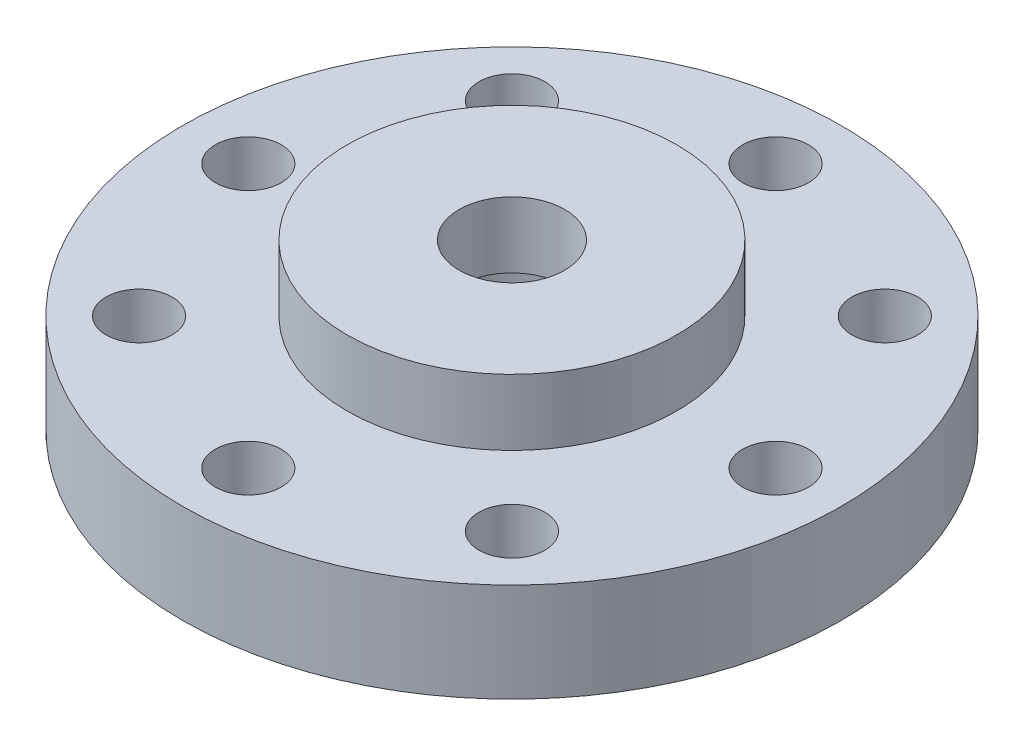
ISO-10303-21;
HEADER;
FILE_DESCRIPTION(('STEP AP214'),'2;1');
FILE_NAME('part.step','',(''),(''),'','','');
FILE_SCHEMA(('AUTOMOTIVE_DESIGN { 1 0 10303 214 1 1 1 1 }'));
ENDSEC;
DATA;
#1=APPLICATION_CONTEXT('core data for automotive mechanical design processes');
#2=APPLICATION_PROTOCOL_DEFINITION('international standard','automotive_design',2000,#1);
#3=PRODUCT_CONTEXT('',#1,'mechanical');
#4=PRODUCT('Part','Part','',(#3));
#5=PRODUCT_RELATED_PRODUCT_CATEGORY('part','',(#4));
#6=PRODUCT_DEFINITION_FORMATION('','',#4);
#7=PRODUCT_DEFINITION_CONTEXT('part definition',#1,'design');
#8=PRODUCT_DEFINITION('design','',#6,#7);
#9=PRODUCT_DEFINITION_SHAPE('','',#8);
#10=(LENGTH_UNIT() NAMED_UNIT(*) SI_UNIT(.MILLI.,.METRE.));
#11=(NAMED_UNIT(*) PLANE_ANGLE_UNIT() SI_UNIT($,.RADIAN.));
#12=(NAMED_UNIT(*) SI_UNIT($,.STERADIAN.) SOLID_ANGLE_UNIT());
#13=UNCERTAINTY_MEASURE_WITH_UNIT(LENGTH_MEASURE(1.E-05),#10,'distance_accuracy_value','');
#14=(GEOMETRIC_REPRESENTATION_CONTEXT(3) GLOBAL_UNCERTAINTY_ASSIGNED_CONTEXT((#13)) GLOBAL_UNIT_ASSIGNED_CONTEXT((#10,
#11,#12)) REPRESENTATION_CONTEXT('',''));
#15=CARTESIAN_POINT('',(0.,0.,0.));
#16=DIRECTION('',(0.,0.,1.));
#17=DIRECTION('',(1.,0.,0.));
#18=AXIS2_PLACEMENT_3D('',#15,#16,#17);
#19=CARTESIAN_POINT('',(0.,5.,0.));
#20=DIRECTION('',(0.,-1.,0.));
#21=DIRECTION('',(0.,0.,-1.));
#22=AXIS2_PLACEMENT_3D('',#19,#20,#21);
#23=CYLINDRICAL_SURFACE('',#22,1.6);
#24=CARTESIAN_POINT('',(0.,5.,0.));
#25=DIRECTION('',(0.,-1.,0.));
#26=DIRECTION('',(0.,0.,-1.));
#27=AXIS2_PLACEMENT_3D('',#24,#25,#26);
#28=CIRCLE('',#27,1.6);
#29=CARTESIAN_POINT('',(0.,5.,-1.6));
#30=VERTEX_POINT('',#29);
#31=EDGE_CURVE('E99',#30,#30,#28,.T.);
#32=ORIENTED_EDGE('',*,*,#31,.F.);
#33=EDGE_LOOP('',(#32));
#34=FACE_BOUND('',#33,.T.);
#35=CARTESIAN_POINT('',(0.,3.,0.));
#36=DIRECTION('',(0.,-1.,0.));
#37=DIRECTION('',(0.,0.,-1.));
#38=AXIS2_PLACEMENT_3D('',#35,#36,#37);
#39=CIRCLE('',#38,1.6);
#40=CARTESIAN_POINT('',(0.,3.,-1.6));
#41=VERTEX_POINT('',#40);
#42=EDGE_CURVE('E41',#41,#41,#39,.F.);
#43=ORIENTED_EDGE('',*,*,#42,.F.);
#44=EDGE_LOOP('',(#43));
#45=FACE_BOUND('',#44,.T.);
#46=ADVANCED_FACE('F37',(#34,#45),#23,.F.);
#47=CARTESIAN_POINT('',(0.,3.,0.));
#48=DIRECTION('',(0.,-1.,0.));
#49=DIRECTION('',(0.,0.,-1.));
#50=AXIS2_PLACEMENT_3D('',#47,#48,#49);
#51=CYLINDRICAL_SURFACE('',#50,10.);
#52=CARTESIAN_POINT('',(0.,3.,0.));
#53=DIRECTION('',(0.,1.,0.));
#54=DIRECTION('',(0.,0.,1.));
#55=AXIS2_PLACEMENT_3D('',#52,#53,#54);
#56=CIRCLE('',#55,10.);
#57=CARTESIAN_POINT('',(0.,3.,10.));
#58=VERTEX_POINT('',#57);
#59=EDGE_CURVE('E46',#58,#58,#56,.T.);
#60=ORIENTED_EDGE('',*,*,#59,.F.);
#61=EDGE_LOOP('',(#60));
#62=FACE_BOUND('',#61,.T.);
#63=CARTESIAN_POINT('',(0.,0.,0.));
#64=DIRECTION('',(0.,1.,0.));
#65=DIRECTION('',(0.,0.,1.));
#66=AXIS2_PLACEMENT_3D('',#63,#64,#65);
#67=CIRCLE('',#66,10.);
#68=CARTESIAN_POINT('',(0.,0.,10.));
#69=VERTEX_POINT('',#68);
#70=EDGE_CURVE('E52',#69,#69,#67,.T.);
#71=ORIENTED_EDGE('',*,*,#70,.T.);
#72=EDGE_LOOP('',(#71));
#73=FACE_BOUND('',#72,.T.);
#74=ADVANCED_FACE('F39',(#62,#73),#51,.T.);
#75=CARTESIAN_POINT('',(0.,3.,0.));
#76=DIRECTION('',(0.,1.,0.));
#77=DIRECTION('',(0.,0.,1.));
#78=AXIS2_PLACEMENT_3D('',#75,#76,#77);
#79=PLANE('',#78);
#80=CARTESIAN_POINT('',(0.,3.,8.));
#81=DIRECTION('',(0.,1.,0.));
#82=DIRECTION('',(0.,0.,1.));
#83=AXIS2_PLACEMENT_3D('',#80,#81,#82);
#84=CIRCLE('',#83,1.);
#85=CARTESIAN_POINT('',(0.,3.,9.));
#86=VERTEX_POINT('',#85);
#87=EDGE_CURVE('E63',#86,#86,#84,.T.);
#88=ORIENTED_EDGE('',*,*,#87,.F.);
#89=EDGE_LOOP('',(#88));
#90=FACE_BOUND('',#89,.T.);
#91=CARTESIAN_POINT('',(5.65685424949245,3.,5.65685424949262));
#92=DIRECTION('',(0.,1.,0.));
#93=DIRECTION('',(0.,0.,1.));
#94=AXIS2_PLACEMENT_3D('',#91,#92,#93);
#95=CIRCLE('',#94,1.);
#96=CARTESIAN_POINT('',(5.65685424949245,3.,6.65685424949262));
#97=VERTEX_POINT('',#96);
#98=EDGE_CURVE('E68',#97,#97,#95,.T.);
#99=ORIENTED_EDGE('',*,*,#98,.F.);
#100=EDGE_LOOP('',(#99));
#101=FACE_BOUND('',#100,.T.);
#102=CARTESIAN_POINT('',(8.00000000000031,3.,3.39631537166297E-13));
#103=DIRECTION('',(0.,1.,0.));
#104=DIRECTION('',(0.,0.,1.));
#105=AXIS2_PLACEMENT_3D('',#102,#103,#104);
#106=CIRCLE('',#105,1.);
#107=CARTESIAN_POINT('',(8.00000000000031,3.,1.00000000000034));
#108=VERTEX_POINT('',#107);
#109=EDGE_CURVE('E73',#108,#108,#106,.T.);
#110=ORIENTED_EDGE('',*,*,#109,.F.);
#111=EDGE_LOOP('',(#110));
#112=FACE_BOUND('',#111,.T.);
#113=CARTESIAN_POINT('',(5.65685424949293,3.,-5.65685424949214));
#114=DIRECTION('',(0.,1.,0.));
#115=DIRECTION('',(0.,0.,1.));
#116=AXIS2_PLACEMENT_3D('',#113,#114,#115);
#117=CIRCLE('',#116,1.);
#118=CARTESIAN_POINT('',(5.65685424949293,3.,-4.65685424949214));
#119=VERTEX_POINT('',#118);
#120=EDGE_CURVE('E79',#119,#119,#117,.T.);
#121=ORIENTED_EDGE('',*,*,#120,.F.);
#122=EDGE_LOOP('',(#121));
#123=FACE_BOUND('',#122,.T.);
#124=CARTESIAN_POINT('',(6.5104174407985E-13,3.,-8.));
#125=DIRECTION('',(0.,1.,0.));
#126=DIRECTION('',(0.,0.,1.));
#127=AXIS2_PLACEMENT_3D('',#124,#125,#126);
#128=CIRCLE('',#127,1.);
#129=CARTESIAN_POINT('',(6.5104174407985E-13,3.,-7.));
#130=VERTEX_POINT('',#129);
#131=EDGE_CURVE('E83',#130,#130,#128,.T.);
#132=ORIENTED_EDGE('',*,*,#131,.F.);
#133=EDGE_LOOP('',(#132));
#134=FACE_BOUND('',#133,.T.);
#135=CARTESIAN_POINT('',(-5.65685424949183,3.,-5.65685424949262));
#136=DIRECTION('',(0.,1.,0.));
#137=DIRECTION('',(0.,0.,1.));
#138=AXIS2_PLACEMENT_3D('',#135,#136,#137);
#139=CIRCLE('',#138,0.999999999999999);
#140=CARTESIAN_POINT('',(-5.65685424949183,3.,-4.65685424949262));
#141=VERTEX_POINT('',#140);
#142=EDGE_CURVE('E87',#141,#141,#139,.T.);
#143=ORIENTED_EDGE('',*,*,#142,.F.);
#144=EDGE_LOOP('',(#143));
#145=FACE_BOUND('',#144,.T.);
#146=CARTESIAN_POINT('',(-7.99999999999969,3.,-3.40530054284763E-13));
#147=DIRECTION('',(0.,1.,0.));
#148=DIRECTION('',(0.,0.,1.));
#149=AXIS2_PLACEMENT_3D('',#146,#147,#148);
#150=CIRCLE('',#149,1.);
#151=CARTESIAN_POINT('',(-7.99999999999969,3.,0.999999999999659));
#152=VERTEX_POINT('',#151);
#153=EDGE_CURVE('E91',#152,#152,#150,.T.);
#154=ORIENTED_EDGE('',*,*,#153,.F.);
#155=EDGE_LOOP('',(#154));
#156=FACE_BOUND('',#155,.T.);
#157=CARTESIAN_POINT('',(-5.65685424949231,3.,5.65685424949214));
#158=DIRECTION('',(0.,1.,0.));
#159=DIRECTION('',(0.,0.,1.));
#160=AXIS2_PLACEMENT_3D('',#157,#158,#159);
#161=CIRCLE('',#160,0.999999999999999);
#162=CARTESIAN_POINT('',(-5.65685424949231,3.,6.65685424949214));
#163=VERTEX_POINT('',#162);
#164=EDGE_CURVE('E95',#163,#163,#161,.T.);
#165=ORIENTED_EDGE('',*,*,#164,.F.);
#166=EDGE_LOOP('',(#165));
#167=FACE_BOUND('',#166,.T.);
#168=CARTESIAN_POINT('',(0.,3.,0.));
#169=DIRECTION('',(0.,1.,0.));
#170=DIRECTION('',(0.,0.,1.));
#171=AXIS2_PLACEMENT_3D('',#168,#169,#170);
#172=CIRCLE('',#171,5.);
#173=CARTESIAN_POINT('',(0.,3.,5.));
#174=VERTEX_POINT('',#173);
#175=EDGE_CURVE('E10',#174,#174,#172,.T.);
#176=ORIENTED_EDGE('',*,*,#175,.F.);
#177=EDGE_LOOP('',(#176));
#178=FACE_BOUND('',#177,.T.);
#179=ORIENTED_EDGE('',*,*,#59,.T.);
#180=EDGE_LOOP('',(#179));
#181=FACE_BOUND('',#180,.T.);
#182=ADVANCED_FACE('F156',(#90,#101,#112,#123,#134,#145,#156,#167,#178,#181),#79,.T.);
#183=CARTESIAN_POINT('',(0.,0.,0.));
#184=DIRECTION('',(0.,1.,0.));
#185=DIRECTION('',(0.,0.,1.));
#186=AXIS2_PLACEMENT_3D('',#183,#184,#185);
#187=PLANE('',#186);
#188=CARTESIAN_POINT('',(0.,0.,0.));
#189=DIRECTION('',(0.,-1.,0.));
#190=DIRECTION('',(0.,0.,-1.));
#191=AXIS2_PLACEMENT_3D('',#188,#189,#190);
#192=CIRCLE('',#191,3.);
#193=CARTESIAN_POINT('',(0.,0.,-3.));
#194=VERTEX_POINT('',#193);
#195=EDGE_CURVE('E135',#194,#194,#192,.T.);
#196=ORIENTED_EDGE('',*,*,#195,.F.);
#197=EDGE_LOOP('',(#196));
#198=FACE_BOUND('',#197,.T.);
#199=CARTESIAN_POINT('',(0.,0.,8.));
#200=DIRECTION('',(0.,-1.,0.));
#201=DIRECTION('',(0.,0.,-1.));
#202=AXIS2_PLACEMENT_3D('',#199,#200,#201);
#203=CIRCLE('',#202,1.);
#204=CARTESIAN_POINT('',(0.,0.,7.));
#205=VERTEX_POINT('',#204);
#206=EDGE_CURVE('E103',#205,#205,#203,.T.);
#207=ORIENTED_EDGE('',*,*,#206,.F.);
#208=EDGE_LOOP('',(#207));
#209=FACE_BOUND('',#208,.T.);
#210=CARTESIAN_POINT('',(5.65685424949245,0.,5.65685424949262));
#211=DIRECTION('',(0.,-1.,0.));
#212=DIRECTION('',(0.,0.,-1.));
#213=AXIS2_PLACEMENT_3D('',#210,#211,#212);
#214=CIRCLE('',#213,1.);
#215=CARTESIAN_POINT('',(5.65685424949245,0.,4.65685424949262));
#216=VERTEX_POINT('',#215);
#217=EDGE_CURVE('E113',#216,#216,#214,.T.);
#218=ORIENTED_EDGE('',*,*,#217,.F.);
#219=EDGE_LOOP('',(#218));
#220=FACE_BOUND('',#219,.T.);
#221=CARTESIAN_POINT('',(8.00000000000031,0.,3.39631537166297E-13));
#222=DIRECTION('',(0.,-1.,0.));
#223=DIRECTION('',(0.,0.,-1.));
#224=AXIS2_PLACEMENT_3D('',#221,#222,#223);
#225=CIRCLE('',#224,1.);
#226=CARTESIAN_POINT('',(8.00000000000031,0.,-0.999999999999662));
#227=VERTEX_POINT('',#226);
#228=EDGE_CURVE('E108',#227,#227,#225,.T.);
#229=ORIENTED_EDGE('',*,*,#228,.F.);
#230=EDGE_LOOP('',(#229));
#231=FACE_BOUND('',#230,.T.);
#232=CARTESIAN_POINT('',(5.65685424949293,0.,-5.65685424949214));
#233=DIRECTION('',(0.,-1.,0.));
#234=DIRECTION('',(0.,0.,-1.));
#235=AXIS2_PLACEMENT_3D('',#232,#233,#234);
#236=CIRCLE('',#235,1.);
#237=CARTESIAN_POINT('',(5.65685424949293,0.,-6.65685424949214));
#238=VERTEX_POINT('',#237);
#239=EDGE_CURVE('E104',#238,#238,#236,.T.);
#240=ORIENTED_EDGE('',*,*,#239,.F.);
#241=EDGE_LOOP('',(#240));
#242=FACE_BOUND('',#241,.T.);
#243=CARTESIAN_POINT('',(6.5104174407985E-13,0.,-8.));
#244=DIRECTION('',(0.,-1.,0.));
#245=DIRECTION('',(0.,0.,-1.));
#246=AXIS2_PLACEMENT_3D('',#243,#244,#245);
#247=CIRCLE('',#246,1.);
#248=CARTESIAN_POINT('',(6.5104174407985E-13,0.,-9.));
#249=VERTEX_POINT('',#248);
#250=EDGE_CURVE('E109',#249,#249,#247,.T.);
#251=ORIENTED_EDGE('',*,*,#250,.F.);
#252=EDGE_LOOP('',(#251));
#253=FACE_BOUND('',#252,.T.);
#254=CARTESIAN_POINT('',(-5.65685424949183,0.,-5.65685424949262));
#255=DIRECTION('',(0.,-1.,0.));
#256=DIRECTION('',(0.,0.,-1.));
#257=AXIS2_PLACEMENT_3D('',#254,#255,#256);
#258=CIRCLE('',#257,0.999999999999999);
#259=CARTESIAN_POINT('',(-5.65685424949183,0.,-6.65685424949262));
#260=VERTEX_POINT('',#259);
#261=EDGE_CURVE('E128',#260,#260,#258,.T.);
#262=ORIENTED_EDGE('',*,*,#261,.F.);
#263=EDGE_LOOP('',(#262));
#264=FACE_BOUND('',#263,.T.);
#265=CARTESIAN_POINT('',(-7.99999999999969,0.,-3.40530054284763E-13));
#266=DIRECTION('',(0.,-1.,0.));
#267=DIRECTION('',(0.,0.,-1.));
#268=AXIS2_PLACEMENT_3D('',#265,#266,#267);
#269=CIRCLE('',#268,1.);
#270=CARTESIAN_POINT('',(-7.99999999999969,0.,-1.00000000000034));
#271=VERTEX_POINT('',#270);
#272=EDGE_CURVE('E124',#271,#271,#269,.T.);
#273=ORIENTED_EDGE('',*,*,#272,.F.);
#274=EDGE_LOOP('',(#273));
#275=FACE_BOUND('',#274,.T.);
#276=CARTESIAN_POINT('',(-5.65685424949231,0.,5.65685424949214));
#277=DIRECTION('',(0.,-1.,0.));
#278=DIRECTION('',(0.,0.,-1.));
#279=AXIS2_PLACEMENT_3D('',#276,#277,#278);
#280=CIRCLE('',#279,0.999999999999999);
#281=CARTESIAN_POINT('',(-5.65685424949231,0.,4.65685424949214));
#282=VERTEX_POINT('',#281);
#283=EDGE_CURVE('E120',#282,#282,#280,.T.);
#284=ORIENTED_EDGE('',*,*,#283,.F.);
#285=EDGE_LOOP('',(#284));
#286=FACE_BOUND('',#285,.T.);
#287=ORIENTED_EDGE('',*,*,#70,.F.);
#288=EDGE_LOOP('',(#287));
#289=FACE_BOUND('',#288,.T.);
#290=ADVANCED_FACE('F171',(#198,#209,#220,#231,#242,#253,#264,#275,#286,#289),#187,.F.);
#291=CARTESIAN_POINT('',(0.,5.,0.));
#292=DIRECTION('',(0.,-1.,0.));
#293=DIRECTION('',(0.,0.,-1.));
#294=AXIS2_PLACEMENT_3D('',#291,#292,#293);
#295=CYLINDRICAL_SURFACE('',#294,5.);
#296=CARTESIAN_POINT('',(0.,5.,0.));
#297=DIRECTION('',(0.,1.,0.));
#298=DIRECTION('',(0.,0.,1.));
#299=AXIS2_PLACEMENT_3D('',#296,#297,#298);
#300=CIRCLE('',#299,5.);
#301=CARTESIAN_POINT('',(0.,5.,5.));
#302=VERTEX_POINT('',#301);
#303=EDGE_CURVE('E55',#302,#302,#300,.T.);
#304=ORIENTED_EDGE('',*,*,#303,.F.);
#305=EDGE_LOOP('',(#304));
#306=FACE_BOUND('',#305,.T.);
#307=ORIENTED_EDGE('',*,*,#175,.T.);
#308=EDGE_LOOP('',(#307));
#309=FACE_BOUND('',#308,.T.);
#310=ADVANCED_FACE('F167',(#306,#309),#295,.T.);
#311=CARTESIAN_POINT('',(0.,5.,0.));
#312=DIRECTION('',(0.,1.,0.));
#313=DIRECTION('',(0.,0.,1.));
#314=AXIS2_PLACEMENT_3D('',#311,#312,#313);
#315=PLANE('',#314);
#316=ORIENTED_EDGE('',*,*,#31,.T.);
#317=EDGE_LOOP('',(#316));
#318=FACE_BOUND('',#317,.T.);
#319=ORIENTED_EDGE('',*,*,#303,.T.);
#320=EDGE_LOOP('',(#319));
#321=FACE_BOUND('',#320,.T.);
#322=ADVANCED_FACE('F163',(#318,#321),#315,.T.);
#323=CARTESIAN_POINT('',(-5.65685424949231,5.,5.65685424949214));
#324=DIRECTION('',(0.,-1.,0.));
#325=DIRECTION('',(0.,0.,-1.));
#326=AXIS2_PLACEMENT_3D('',#323,#324,#325);
#327=CYLINDRICAL_SURFACE('',#326,0.999999999999999);
#328=ORIENTED_EDGE('',*,*,#164,.T.);
#329=EDGE_LOOP('',(#328));
#330=FACE_BOUND('',#329,.T.);
#331=ORIENTED_EDGE('',*,*,#283,.T.);
#332=EDGE_LOOP('',(#331));
#333=FACE_BOUND('',#332,.T.);
#334=ADVANCED_FACE('F166',(#330,#333),#327,.F.);
#335=CARTESIAN_POINT('',(-7.99999999999969,5.,-3.40530054284763E-13));
#336=DIRECTION('',(0.,-1.,0.));
#337=DIRECTION('',(0.,0.,-1.));
#338=AXIS2_PLACEMENT_3D('',#335,#336,#337);
#339=CYLINDRICAL_SURFACE('',#338,1.);
#340=ORIENTED_EDGE('',*,*,#153,.T.);
#341=EDGE_LOOP('',(#340));
#342=FACE_BOUND('',#341,.T.);
#343=ORIENTED_EDGE('',*,*,#272,.T.);
#344=EDGE_LOOP('',(#343));
#345=FACE_BOUND('',#344,.T.);
#346=ADVANCED_FACE('F199',(#342,#345),#339,.F.);
#347=CARTESIAN_POINT('',(-5.65685424949183,5.,-5.65685424949262));
#348=DIRECTION('',(0.,-1.,0.));
#349=DIRECTION('',(0.,0.,-1.));
#350=AXIS2_PLACEMENT_3D('',#347,#348,#349);
#351=CYLINDRICAL_SURFACE('',#350,0.999999999999999);
#352=ORIENTED_EDGE('',*,*,#142,.T.);
#353=EDGE_LOOP('',(#352));
#354=FACE_BOUND('',#353,.T.);
#355=ORIENTED_EDGE('',*,*,#261,.T.);
#356=EDGE_LOOP('',(#355));
#357=FACE_BOUND('',#356,.T.);
#358=ADVANCED_FACE('F205',(#354,#357),#351,.F.);
#359=CARTESIAN_POINT('',(6.5104174407985E-13,5.,-8.));
#360=DIRECTION('',(0.,-1.,0.));
#361=DIRECTION('',(0.,0.,-1.));
#362=AXIS2_PLACEMENT_3D('',#359,#360,#361);
#363=CYLINDRICAL_SURFACE('',#362,1.);
#364=ORIENTED_EDGE('',*,*,#131,.T.);
#365=EDGE_LOOP('',(#364));
#366=FACE_BOUND('',#365,.T.);
#367=ORIENTED_EDGE('',*,*,#250,.T.);
#368=EDGE_LOOP('',(#367));
#369=FACE_BOUND('',#368,.T.);
#370=ADVANCED_FACE('F222',(#366,#369),#363,.F.);
#371=CARTESIAN_POINT('',(5.65685424949293,5.,-5.65685424949214));
#372=DIRECTION('',(0.,-1.,0.));
#373=DIRECTION('',(0.,0.,-1.));
#374=AXIS2_PLACEMENT_3D('',#371,#372,#373);
#375=CYLINDRICAL_SURFACE('',#374,1.);
#376=ORIENTED_EDGE('',*,*,#120,.T.);
#377=EDGE_LOOP('',(#376));
#378=FACE_BOUND('',#377,.T.);
#379=ORIENTED_EDGE('',*,*,#239,.T.);
#380=EDGE_LOOP('',(#379));
#381=FACE_BOUND('',#380,.T.);
#382=ADVANCED_FACE('F161',(#378,#381),#375,.F.);
#383=CARTESIAN_POINT('',(8.00000000000031,5.,3.39631537166297E-13));
#384=DIRECTION('',(0.,-1.,0.));
#385=DIRECTION('',(0.,0.,-1.));
#386=AXIS2_PLACEMENT_3D('',#383,#384,#385);
#387=CYLINDRICAL_SURFACE('',#386,1.);
#388=ORIENTED_EDGE('',*,*,#109,.T.);
#389=EDGE_LOOP('',(#388));
#390=FACE_BOUND('',#389,.T.);
#391=ORIENTED_EDGE('',*,*,#228,.T.);
#392=EDGE_LOOP('',(#391));
#393=FACE_BOUND('',#392,.T.);
#394=ADVANCED_FACE('F215',(#390,#393),#387,.F.);
#395=CARTESIAN_POINT('',(5.65685424949245,5.,5.65685424949262));
#396=DIRECTION('',(0.,-1.,0.));
#397=DIRECTION('',(0.,0.,-1.));
#398=AXIS2_PLACEMENT_3D('',#395,#396,#397);
#399=CYLINDRICAL_SURFACE('',#398,1.);
#400=ORIENTED_EDGE('',*,*,#98,.T.);
#401=EDGE_LOOP('',(#400));
#402=FACE_BOUND('',#401,.T.);
#403=ORIENTED_EDGE('',*,*,#217,.T.);
#404=EDGE_LOOP('',(#403));
#405=FACE_BOUND('',#404,.T.);
#406=ADVANCED_FACE('F213',(#402,#405),#399,.F.);
#407=CARTESIAN_POINT('',(0.,5.,8.));
#408=DIRECTION('',(0.,-1.,0.));
#409=DIRECTION('',(0.,0.,-1.));
#410=AXIS2_PLACEMENT_3D('',#407,#408,#409);
#411=CYLINDRICAL_SURFACE('',#410,1.);
#412=ORIENTED_EDGE('',*,*,#87,.T.);
#413=EDGE_LOOP('',(#412));
#414=FACE_BOUND('',#413,.T.);
#415=ORIENTED_EDGE('',*,*,#206,.T.);
#416=EDGE_LOOP('',(#415));
#417=FACE_BOUND('',#416,.T.);
#418=ADVANCED_FACE('F210',(#414,#417),#411,.F.);
#419=CARTESIAN_POINT('',(0.,3.,0.));
#420=DIRECTION('',(0.,-1.,0.));
#421=DIRECTION('',(0.,0.,-1.));
#422=AXIS2_PLACEMENT_3D('',#419,#420,#421);
#423=PLANE('',#422);
#424=CARTESIAN_POINT('',(0.,3.,0.));
#425=DIRECTION('',(0.,-1.,0.));
#426=DIRECTION('',(0.,0.,-1.));
#427=AXIS2_PLACEMENT_3D('',#424,#425,#426);
#428=CIRCLE('',#427,3.);
#429=CARTESIAN_POINT('',(0.,3.,-3.));
#430=VERTEX_POINT('',#429);
#431=EDGE_CURVE('E139',#430,#430,#428,.T.);
#432=ORIENTED_EDGE('',*,*,#431,.T.);
#433=EDGE_LOOP('',(#432));
#434=FACE_BOUND('',#433,.T.);
#435=ORIENTED_EDGE('',*,*,#42,.T.);
#436=EDGE_LOOP('',(#435));
#437=FACE_BOUND('',#436,.T.);
#438=ADVANCED_FACE('F148',(#434,#437),#423,.T.);
#439=CARTESIAN_POINT('',(0.,3.,0.));
#440=DIRECTION('',(0.,-1.,0.));
#441=DIRECTION('',(0.,0.,-1.));
#442=AXIS2_PLACEMENT_3D('',#439,#440,#441);
#443=CYLINDRICAL_SURFACE('',#442,3.);
#444=ORIENTED_EDGE('',*,*,#431,.F.);
#445=EDGE_LOOP('',(#444));
#446=FACE_BOUND('',#445,.T.);
#447=ORIENTED_EDGE('',*,*,#195,.T.);
#448=EDGE_LOOP('',(#447));
#449=FACE_BOUND('',#448,.T.);
#450=ADVANCED_FACE('F250',(#446,#449),#443,.F.);
#451=CLOSED_SHELL('',(#46,#74,#182,#290,#310,#322,#334,#346,#358,#370,#382,#394,#406,#418,#438,#450));
#452=MANIFOLD_SOLID_BREP('B2',#451);
#453=ADVANCED_BREP_SHAPE_REPRESENTATION('',(#18,#452),#14);
#454=SHAPE_DEFINITION_REPRESENTATION(#9,#453);
ENDSEC;
END-ISO-10303-21;
